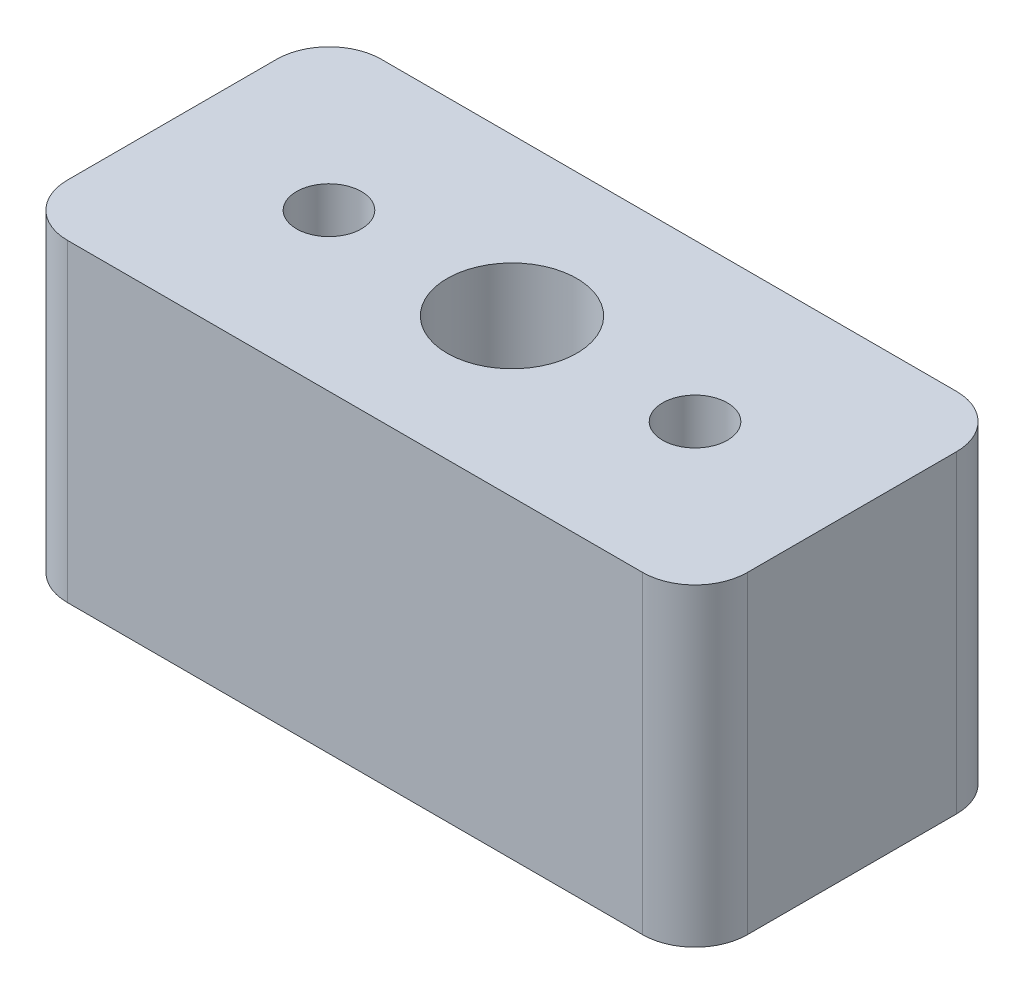
ISO-10303-21;
HEADER;
FILE_DESCRIPTION(('STEP AP214'),'2;1');
FILE_NAME('part.step','',(''),(''),'','','');
FILE_SCHEMA(('AUTOMOTIVE_DESIGN { 1 0 10303 214 1 1 1 1 }'));
ENDSEC;
DATA;
#1=APPLICATION_CONTEXT('core data for automotive mechanical design processes');
#2=APPLICATION_PROTOCOL_DEFINITION('international standard','automotive_design',2000,#1);
#3=PRODUCT_CONTEXT('',#1,'mechanical');
#4=PRODUCT('Part','Part','',(#3));
#5=PRODUCT_RELATED_PRODUCT_CATEGORY('part','',(#4));
#6=PRODUCT_DEFINITION_FORMATION('','',#4);
#7=PRODUCT_DEFINITION_CONTEXT('part definition',#1,'design');
#8=PRODUCT_DEFINITION('design','',#6,#7);
#9=PRODUCT_DEFINITION_SHAPE('','',#8);
#10=(LENGTH_UNIT() NAMED_UNIT(*) SI_UNIT(.MILLI.,.METRE.));
#11=(NAMED_UNIT(*) PLANE_ANGLE_UNIT() SI_UNIT($,.RADIAN.));
#12=(NAMED_UNIT(*) SI_UNIT($,.STERADIAN.) SOLID_ANGLE_UNIT());
#13=UNCERTAINTY_MEASURE_WITH_UNIT(LENGTH_MEASURE(1.E-05),#10,'distance_accuracy_value','');
#14=(GEOMETRIC_REPRESENTATION_CONTEXT(3) GLOBAL_UNCERTAINTY_ASSIGNED_CONTEXT((#13)) GLOBAL_UNIT_ASSIGNED_CONTEXT((#10,
#11,#12)) REPRESENTATION_CONTEXT('',''));
#15=CARTESIAN_POINT('',(0.,0.,0.));
#16=DIRECTION('',(0.,0.,1.));
#17=DIRECTION('',(1.,0.,0.));
#18=AXIS2_PLACEMENT_3D('',#15,#16,#17);
#19=CARTESIAN_POINT('',(0.,3.,0.));
#20=DIRECTION('',(0.,-1.,0.));
#21=DIRECTION('',(0.,0.,-1.));
#22=AXIS2_PLACEMENT_3D('',#19,#20,#21);
#23=PLANE('',#22);
#24=CARTESIAN_POINT('',(0.,3.,0.));
#25=DIRECTION('',(0.,1.,0.));
#26=DIRECTION('',(0.,0.,1.));
#27=AXIS2_PLACEMENT_3D('',#24,#25,#26);
#28=CIRCLE('',#27,0.62);
#29=CARTESIAN_POINT('',(0.,3.,0.62));
#30=VERTEX_POINT('',#29);
#31=EDGE_CURVE('E181',#30,#30,#28,.T.);
#32=ORIENTED_EDGE('',*,*,#31,.F.);
#33=EDGE_LOOP('',(#32));
#34=FACE_BOUND('',#33,.T.);
#35=DIRECTION('',(1.,0.,0.));
#36=VECTOR('',#35,1.);
#37=CARTESIAN_POINT('',(-3.25,3.,1.5));
#38=LINE('',#37,#36);
#39=CARTESIAN_POINT('',(-2.75,3.,1.5));
#40=VERTEX_POINT('',#39);
#41=CARTESIAN_POINT('',(2.75,3.,1.5));
#42=VERTEX_POINT('',#41);
#43=EDGE_CURVE('E167',#40,#42,#38,.T.);
#44=ORIENTED_EDGE('',*,*,#43,.T.);
#45=CARTESIAN_POINT('',(2.75,3.,1.));
#46=DIRECTION('',(0.,-1.,0.));
#47=DIRECTION('',(0.,0.,-1.));
#48=AXIS2_PLACEMENT_3D('',#45,#46,#47);
#49=CIRCLE('',#48,0.5);
#50=CARTESIAN_POINT('',(3.25,3.,1.));
#51=VERTEX_POINT('',#50);
#52=EDGE_CURVE('E148',#42,#51,#49,.F.);
#53=ORIENTED_EDGE('',*,*,#52,.T.);
#54=DIRECTION('',(0.,0.,-1.));
#55=VECTOR('',#54,1.);
#56=CARTESIAN_POINT('',(3.25,3.,1.5));
#57=LINE('',#56,#55);
#58=CARTESIAN_POINT('',(3.25,3.,-1.));
#59=VERTEX_POINT('',#58);
#60=EDGE_CURVE('E118',#51,#59,#57,.T.);
#61=ORIENTED_EDGE('',*,*,#60,.T.);
#62=CARTESIAN_POINT('',(2.75,3.,-1.));
#63=DIRECTION('',(0.,-1.,0.));
#64=DIRECTION('',(0.,0.,-1.));
#65=AXIS2_PLACEMENT_3D('',#62,#63,#64);
#66=CIRCLE('',#65,0.5);
#67=CARTESIAN_POINT('',(2.75,3.,-1.5));
#68=VERTEX_POINT('',#67);
#69=EDGE_CURVE('E54',#59,#68,#66,.F.);
#70=ORIENTED_EDGE('',*,*,#69,.T.);
#71=DIRECTION('',(-1.,0.,0.));
#72=VECTOR('',#71,1.);
#73=CARTESIAN_POINT('',(-3.25,3.,-1.5));
#74=LINE('',#73,#72);
#75=CARTESIAN_POINT('',(-2.75,3.,-1.5));
#76=VERTEX_POINT('',#75);
#77=EDGE_CURVE('E134',#68,#76,#74,.T.);
#78=ORIENTED_EDGE('',*,*,#77,.T.);
#79=CARTESIAN_POINT('',(-2.75,3.,-1.));
#80=DIRECTION('',(0.,-1.,0.));
#81=DIRECTION('',(0.,0.,-1.));
#82=AXIS2_PLACEMENT_3D('',#79,#80,#81);
#83=CIRCLE('',#82,0.5);
#84=CARTESIAN_POINT('',(-3.25,3.,-1.));
#85=VERTEX_POINT('',#84);
#86=EDGE_CURVE('E145',#76,#85,#83,.F.);
#87=ORIENTED_EDGE('',*,*,#86,.T.);
#88=DIRECTION('',(0.,0.,1.));
#89=VECTOR('',#88,1.);
#90=CARTESIAN_POINT('',(-3.25,3.,1.5));
#91=LINE('',#90,#89);
#92=CARTESIAN_POINT('',(-3.25,3.,1.));
#93=VERTEX_POINT('',#92);
#94=EDGE_CURVE('E128',#85,#93,#91,.T.);
#95=ORIENTED_EDGE('',*,*,#94,.T.);
#96=CARTESIAN_POINT('',(-2.75,3.,1.));
#97=DIRECTION('',(0.,-1.,0.));
#98=DIRECTION('',(0.,0.,-1.));
#99=AXIS2_PLACEMENT_3D('',#96,#97,#98);
#100=CIRCLE('',#99,0.5);
#101=EDGE_CURVE('E143',#93,#40,#100,.F.);
#102=ORIENTED_EDGE('',*,*,#101,.T.);
#103=EDGE_LOOP('',(#44,#53,#61,#70,#78,#87,#95,#102));
#104=FACE_BOUND('',#103,.T.);
#105=CARTESIAN_POINT('',(-1.75,3.,0.));
#106=DIRECTION('',(0.,1.,0.));
#107=DIRECTION('',(0.,0.,1.));
#108=AXIS2_PLACEMENT_3D('',#105,#106,#107);
#109=CIRCLE('',#108,0.31);
#110=CARTESIAN_POINT('',(-1.75,3.,0.31));
#111=VERTEX_POINT('',#110);
#112=EDGE_CURVE('E172',#111,#111,#109,.T.);
#113=ORIENTED_EDGE('',*,*,#112,.F.);
#114=EDGE_LOOP('',(#113));
#115=FACE_BOUND('',#114,.T.);
#116=CARTESIAN_POINT('',(1.75,3.,0.));
#117=DIRECTION('',(0.,1.,0.));
#118=DIRECTION('',(0.,0.,1.));
#119=AXIS2_PLACEMENT_3D('',#116,#117,#118);
#120=CIRCLE('',#119,0.31);
#121=CARTESIAN_POINT('',(1.75,3.,0.31));
#122=VERTEX_POINT('',#121);
#123=EDGE_CURVE('E186',#122,#122,#120,.T.);
#124=ORIENTED_EDGE('',*,*,#123,.F.);
#125=EDGE_LOOP('',(#124));
#126=FACE_BOUND('',#125,.T.);
#127=ADVANCED_FACE('F32',(#34,#104,#115,#126),#23,.F.);
#128=CARTESIAN_POINT('',(0.,0.,0.));
#129=DIRECTION('',(0.,-1.,0.));
#130=DIRECTION('',(0.,0.,-1.));
#131=AXIS2_PLACEMENT_3D('',#128,#129,#130);
#132=PLANE('',#131);
#133=CARTESIAN_POINT('',(0.,0.,0.));
#134=DIRECTION('',(0.,1.,0.));
#135=DIRECTION('',(0.,0.,1.));
#136=AXIS2_PLACEMENT_3D('',#133,#134,#135);
#137=CIRCLE('',#136,0.62);
#138=CARTESIAN_POINT('',(0.,0.,0.62));
#139=VERTEX_POINT('',#138);
#140=EDGE_CURVE('E183',#139,#139,#137,.T.);
#141=ORIENTED_EDGE('',*,*,#140,.T.);
#142=EDGE_LOOP('',(#141));
#143=FACE_BOUND('',#142,.T.);
#144=DIRECTION('',(0.,0.,-1.));
#145=VECTOR('',#144,1.);
#146=CARTESIAN_POINT('',(3.25,0.,1.5));
#147=LINE('',#146,#145);
#148=CARTESIAN_POINT('',(3.25,0.,1.));
#149=VERTEX_POINT('',#148);
#150=CARTESIAN_POINT('',(3.25,0.,-1.));
#151=VERTEX_POINT('',#150);
#152=EDGE_CURVE('E116',#149,#151,#147,.T.);
#153=ORIENTED_EDGE('',*,*,#152,.F.);
#154=CARTESIAN_POINT('',(2.75,0.,1.));
#155=DIRECTION('',(0.,-1.,0.));
#156=DIRECTION('',(0.,0.,-1.));
#157=AXIS2_PLACEMENT_3D('',#154,#155,#156);
#158=CIRCLE('',#157,0.5);
#159=CARTESIAN_POINT('',(2.75,0.,1.5));
#160=VERTEX_POINT('',#159);
#161=EDGE_CURVE('E99',#149,#160,#158,.T.);
#162=ORIENTED_EDGE('',*,*,#161,.T.);
#163=DIRECTION('',(1.,0.,0.));
#164=VECTOR('',#163,1.);
#165=CARTESIAN_POINT('',(-3.25,0.,1.5));
#166=LINE('',#165,#164);
#167=CARTESIAN_POINT('',(-2.75,0.,1.5));
#168=VERTEX_POINT('',#167);
#169=EDGE_CURVE('E126',#168,#160,#166,.T.);
#170=ORIENTED_EDGE('',*,*,#169,.F.);
#171=CARTESIAN_POINT('',(-2.75,0.,1.));
#172=DIRECTION('',(0.,-1.,0.));
#173=DIRECTION('',(0.,0.,-1.));
#174=AXIS2_PLACEMENT_3D('',#171,#172,#173);
#175=CIRCLE('',#174,0.5);
#176=CARTESIAN_POINT('',(-3.25,0.,1.));
#177=VERTEX_POINT('',#176);
#178=EDGE_CURVE('E119',#168,#177,#175,.T.);
#179=ORIENTED_EDGE('',*,*,#178,.T.);
#180=DIRECTION('',(0.,0.,1.));
#181=VECTOR('',#180,1.);
#182=CARTESIAN_POINT('',(-3.25,0.,1.5));
#183=LINE('',#182,#181);
#184=CARTESIAN_POINT('',(-3.25,0.,-1.));
#185=VERTEX_POINT('',#184);
#186=EDGE_CURVE('E130',#185,#177,#183,.T.);
#187=ORIENTED_EDGE('',*,*,#186,.F.);
#188=CARTESIAN_POINT('',(-2.75,0.,-1.));
#189=DIRECTION('',(0.,-1.,0.));
#190=DIRECTION('',(0.,0.,-1.));
#191=AXIS2_PLACEMENT_3D('',#188,#189,#190);
#192=CIRCLE('',#191,0.5);
#193=CARTESIAN_POINT('',(-2.75,0.,-1.5));
#194=VERTEX_POINT('',#193);
#195=EDGE_CURVE('E137',#185,#194,#192,.T.);
#196=ORIENTED_EDGE('',*,*,#195,.T.);
#197=DIRECTION('',(-1.,0.,0.));
#198=VECTOR('',#197,1.);
#199=CARTESIAN_POINT('',(-3.25,0.,-1.5));
#200=LINE('',#199,#198);
#201=CARTESIAN_POINT('',(2.75,0.,-1.5));
#202=VERTEX_POINT('',#201);
#203=EDGE_CURVE('E125',#202,#194,#200,.T.);
#204=ORIENTED_EDGE('',*,*,#203,.F.);
#205=CARTESIAN_POINT('',(2.75,0.,-1.));
#206=DIRECTION('',(0.,-1.,0.));
#207=DIRECTION('',(0.,0.,-1.));
#208=AXIS2_PLACEMENT_3D('',#205,#206,#207);
#209=CIRCLE('',#208,0.5);
#210=EDGE_CURVE('E110',#202,#151,#209,.T.);
#211=ORIENTED_EDGE('',*,*,#210,.T.);
#212=EDGE_LOOP('',(#153,#162,#170,#179,#187,#196,#204,#211));
#213=FACE_BOUND('',#212,.T.);
#214=CARTESIAN_POINT('',(-1.75,0.,0.));
#215=DIRECTION('',(0.,1.,0.));
#216=DIRECTION('',(0.,0.,1.));
#217=AXIS2_PLACEMENT_3D('',#214,#215,#216);
#218=CIRCLE('',#217,0.31);
#219=CARTESIAN_POINT('',(-1.75,0.,0.31));
#220=VERTEX_POINT('',#219);
#221=EDGE_CURVE('E174',#220,#220,#218,.T.);
#222=ORIENTED_EDGE('',*,*,#221,.T.);
#223=EDGE_LOOP('',(#222));
#224=FACE_BOUND('',#223,.T.);
#225=CARTESIAN_POINT('',(1.75,0.,0.));
#226=DIRECTION('',(0.,1.,0.));
#227=DIRECTION('',(0.,0.,1.));
#228=AXIS2_PLACEMENT_3D('',#225,#226,#227);
#229=CIRCLE('',#228,0.31);
#230=CARTESIAN_POINT('',(1.75,0.,0.31));
#231=VERTEX_POINT('',#230);
#232=EDGE_CURVE('E189',#231,#231,#229,.T.);
#233=ORIENTED_EDGE('',*,*,#232,.T.);
#234=EDGE_LOOP('',(#233));
#235=FACE_BOUND('',#234,.T.);
#236=ADVANCED_FACE('F122',(#143,#213,#224,#235),#132,.T.);
#237=CARTESIAN_POINT('',(-3.25,3.,1.5));
#238=DIRECTION('',(1.,0.,0.));
#239=DIRECTION('',(0.,0.,-1.));
#240=AXIS2_PLACEMENT_3D('',#237,#238,#239);
#241=PLANE('',#240);
#242=ORIENTED_EDGE('',*,*,#94,.F.);
#243=DIRECTION('',(0.,-1.,0.));
#244=VECTOR('',#243,1.);
#245=CARTESIAN_POINT('',(-3.25,3.,-1.));
#246=LINE('',#245,#244);
#247=EDGE_CURVE('E11',#85,#185,#246,.T.);
#248=ORIENTED_EDGE('',*,*,#247,.T.);
#249=ORIENTED_EDGE('',*,*,#186,.T.);
#250=DIRECTION('',(0.,-1.,0.));
#251=VECTOR('',#250,1.);
#252=CARTESIAN_POINT('',(-3.25,3.,1.));
#253=LINE('',#252,#251);
#254=EDGE_CURVE('E40',#177,#93,#253,.F.);
#255=ORIENTED_EDGE('',*,*,#254,.T.);
#256=EDGE_LOOP('',(#242,#248,#249,#255));
#257=FACE_BOUND('',#256,.T.);
#258=ADVANCED_FACE('F158',(#257),#241,.F.);
#259=CARTESIAN_POINT('',(-3.25,3.,1.5));
#260=DIRECTION('',(0.,0.,-1.));
#261=DIRECTION('',(-1.,0.,0.));
#262=AXIS2_PLACEMENT_3D('',#259,#260,#261);
#263=PLANE('',#262);
#264=ORIENTED_EDGE('',*,*,#169,.T.);
#265=DIRECTION('',(0.,-1.,0.));
#266=VECTOR('',#265,1.);
#267=CARTESIAN_POINT('',(2.75,3.,1.5));
#268=LINE('',#267,#266);
#269=EDGE_CURVE('E104',#160,#42,#268,.F.);
#270=ORIENTED_EDGE('',*,*,#269,.T.);
#271=ORIENTED_EDGE('',*,*,#43,.F.);
#272=DIRECTION('',(0.,-1.,0.));
#273=VECTOR('',#272,1.);
#274=CARTESIAN_POINT('',(-2.75,3.,1.5));
#275=LINE('',#274,#273);
#276=EDGE_CURVE('E109',#40,#168,#275,.T.);
#277=ORIENTED_EDGE('',*,*,#276,.T.);
#278=EDGE_LOOP('',(#264,#270,#271,#277));
#279=FACE_BOUND('',#278,.T.);
#280=ADVANCED_FACE('F171',(#279),#263,.F.);
#281=CARTESIAN_POINT('',(3.25,3.,1.5));
#282=DIRECTION('',(-1.,0.,0.));
#283=DIRECTION('',(0.,0.,1.));
#284=AXIS2_PLACEMENT_3D('',#281,#282,#283);
#285=PLANE('',#284);
#286=ORIENTED_EDGE('',*,*,#60,.F.);
#287=DIRECTION('',(0.,-1.,0.));
#288=VECTOR('',#287,1.);
#289=CARTESIAN_POINT('',(3.25,3.,1.));
#290=LINE('',#289,#288);
#291=EDGE_CURVE('E103',#51,#149,#290,.T.);
#292=ORIENTED_EDGE('',*,*,#291,.T.);
#293=ORIENTED_EDGE('',*,*,#152,.T.);
#294=DIRECTION('',(0.,-1.,0.));
#295=VECTOR('',#294,1.);
#296=CARTESIAN_POINT('',(3.25,3.,-1.));
#297=LINE('',#296,#295);
#298=EDGE_CURVE('E120',#151,#59,#297,.F.);
#299=ORIENTED_EDGE('',*,*,#298,.T.);
#300=EDGE_LOOP('',(#286,#292,#293,#299));
#301=FACE_BOUND('',#300,.T.);
#302=ADVANCED_FACE('F115',(#301),#285,.F.);
#303=CARTESIAN_POINT('',(-3.25,3.,-1.5));
#304=DIRECTION('',(0.,0.,1.));
#305=DIRECTION('',(1.,0.,0.));
#306=AXIS2_PLACEMENT_3D('',#303,#304,#305);
#307=PLANE('',#306);
#308=ORIENTED_EDGE('',*,*,#77,.F.);
#309=DIRECTION('',(0.,-1.,0.));
#310=VECTOR('',#309,1.);
#311=CARTESIAN_POINT('',(2.75,3.,-1.5));
#312=LINE('',#311,#310);
#313=EDGE_CURVE('E151',#68,#202,#312,.T.);
#314=ORIENTED_EDGE('',*,*,#313,.T.);
#315=ORIENTED_EDGE('',*,*,#203,.T.);
#316=DIRECTION('',(0.,-1.,0.));
#317=VECTOR('',#316,1.);
#318=CARTESIAN_POINT('',(-2.75,3.,-1.5));
#319=LINE('',#318,#317);
#320=EDGE_CURVE('E47',#194,#76,#319,.F.);
#321=ORIENTED_EDGE('',*,*,#320,.T.);
#322=EDGE_LOOP('',(#308,#314,#315,#321));
#323=FACE_BOUND('',#322,.T.);
#324=ADVANCED_FACE('F211',(#323),#307,.F.);
#325=CARTESIAN_POINT('',(-1.75,3.,0.));
#326=DIRECTION('',(0.,-1.,0.));
#327=DIRECTION('',(0.,0.,-1.));
#328=AXIS2_PLACEMENT_3D('',#325,#326,#327);
#329=CYLINDRICAL_SURFACE('',#328,0.31);
#330=ORIENTED_EDGE('',*,*,#112,.T.);
#331=EDGE_LOOP('',(#330));
#332=FACE_BOUND('',#331,.T.);
#333=ORIENTED_EDGE('',*,*,#221,.F.);
#334=EDGE_LOOP('',(#333));
#335=FACE_BOUND('',#334,.T.);
#336=ADVANCED_FACE('F208',(#332,#335),#329,.F.);
#337=CARTESIAN_POINT('',(0.,3.,0.));
#338=DIRECTION('',(0.,-1.,0.));
#339=DIRECTION('',(0.,0.,-1.));
#340=AXIS2_PLACEMENT_3D('',#337,#338,#339);
#341=CYLINDRICAL_SURFACE('',#340,0.62);
#342=ORIENTED_EDGE('',*,*,#31,.T.);
#343=EDGE_LOOP('',(#342));
#344=FACE_BOUND('',#343,.T.);
#345=ORIENTED_EDGE('',*,*,#140,.F.);
#346=EDGE_LOOP('',(#345));
#347=FACE_BOUND('',#346,.T.);
#348=ADVANCED_FACE('F294',(#344,#347),#341,.F.);
#349=CARTESIAN_POINT('',(1.75,3.,0.));
#350=DIRECTION('',(0.,-1.,0.));
#351=DIRECTION('',(0.,0.,-1.));
#352=AXIS2_PLACEMENT_3D('',#349,#350,#351);
#353=CYLINDRICAL_SURFACE('',#352,0.31);
#354=ORIENTED_EDGE('',*,*,#123,.T.);
#355=EDGE_LOOP('',(#354));
#356=FACE_BOUND('',#355,.T.);
#357=ORIENTED_EDGE('',*,*,#232,.F.);
#358=EDGE_LOOP('',(#357));
#359=FACE_BOUND('',#358,.T.);
#360=ADVANCED_FACE('F195',(#356,#359),#353,.F.);
#361=CARTESIAN_POINT('',(2.75,3.,1.));
#362=DIRECTION('',(0.,-1.,0.));
#363=DIRECTION('',(0.,0.,-1.));
#364=AXIS2_PLACEMENT_3D('',#361,#362,#363);
#365=CYLINDRICAL_SURFACE('',#364,0.5);
#366=ORIENTED_EDGE('',*,*,#52,.F.);
#367=ORIENTED_EDGE('',*,*,#269,.F.);
#368=ORIENTED_EDGE('',*,*,#161,.F.);
#369=ORIENTED_EDGE('',*,*,#291,.F.);
#370=EDGE_LOOP('',(#366,#367,#368,#369));
#371=FACE_BOUND('',#370,.T.);
#372=ADVANCED_FACE('F102',(#371),#365,.T.);
#373=CARTESIAN_POINT('',(2.75,3.,-1.));
#374=DIRECTION('',(0.,-1.,0.));
#375=DIRECTION('',(0.,0.,-1.));
#376=AXIS2_PLACEMENT_3D('',#373,#374,#375);
#377=CYLINDRICAL_SURFACE('',#376,0.5);
#378=ORIENTED_EDGE('',*,*,#69,.F.);
#379=ORIENTED_EDGE('',*,*,#298,.F.);
#380=ORIENTED_EDGE('',*,*,#210,.F.);
#381=ORIENTED_EDGE('',*,*,#313,.F.);
#382=EDGE_LOOP('',(#378,#379,#380,#381));
#383=FACE_BOUND('',#382,.T.);
#384=ADVANCED_FACE('F222',(#383),#377,.T.);
#385=CARTESIAN_POINT('',(-2.75,3.,-1.));
#386=DIRECTION('',(0.,-1.,0.));
#387=DIRECTION('',(0.,0.,-1.));
#388=AXIS2_PLACEMENT_3D('',#385,#386,#387);
#389=CYLINDRICAL_SURFACE('',#388,0.5);
#390=ORIENTED_EDGE('',*,*,#86,.F.);
#391=ORIENTED_EDGE('',*,*,#320,.F.);
#392=ORIENTED_EDGE('',*,*,#195,.F.);
#393=ORIENTED_EDGE('',*,*,#247,.F.);
#394=EDGE_LOOP('',(#390,#391,#392,#393));
#395=FACE_BOUND('',#394,.T.);
#396=ADVANCED_FACE('F224',(#395),#389,.T.);
#397=CARTESIAN_POINT('',(-2.75,3.,1.));
#398=DIRECTION('',(0.,-1.,0.));
#399=DIRECTION('',(0.,0.,-1.));
#400=AXIS2_PLACEMENT_3D('',#397,#398,#399);
#401=CYLINDRICAL_SURFACE('',#400,0.5);
#402=ORIENTED_EDGE('',*,*,#101,.F.);
#403=ORIENTED_EDGE('',*,*,#254,.F.);
#404=ORIENTED_EDGE('',*,*,#178,.F.);
#405=ORIENTED_EDGE('',*,*,#276,.F.);
#406=EDGE_LOOP('',(#402,#403,#404,#405));
#407=FACE_BOUND('',#406,.T.);
#408=ADVANCED_FACE('F34',(#407),#401,.T.);
#409=CLOSED_SHELL('',(#127,#236,#258,#280,#302,#324,#336,#348,#360,#372,#384,#396,#408));
#410=MANIFOLD_SOLID_BREP('B2',#409);
#411=ADVANCED_BREP_SHAPE_REPRESENTATION('',(#18,#410),#14);
#412=SHAPE_DEFINITION_REPRESENTATION(#9,#411);
ENDSEC;
END-ISO-10303-21;
